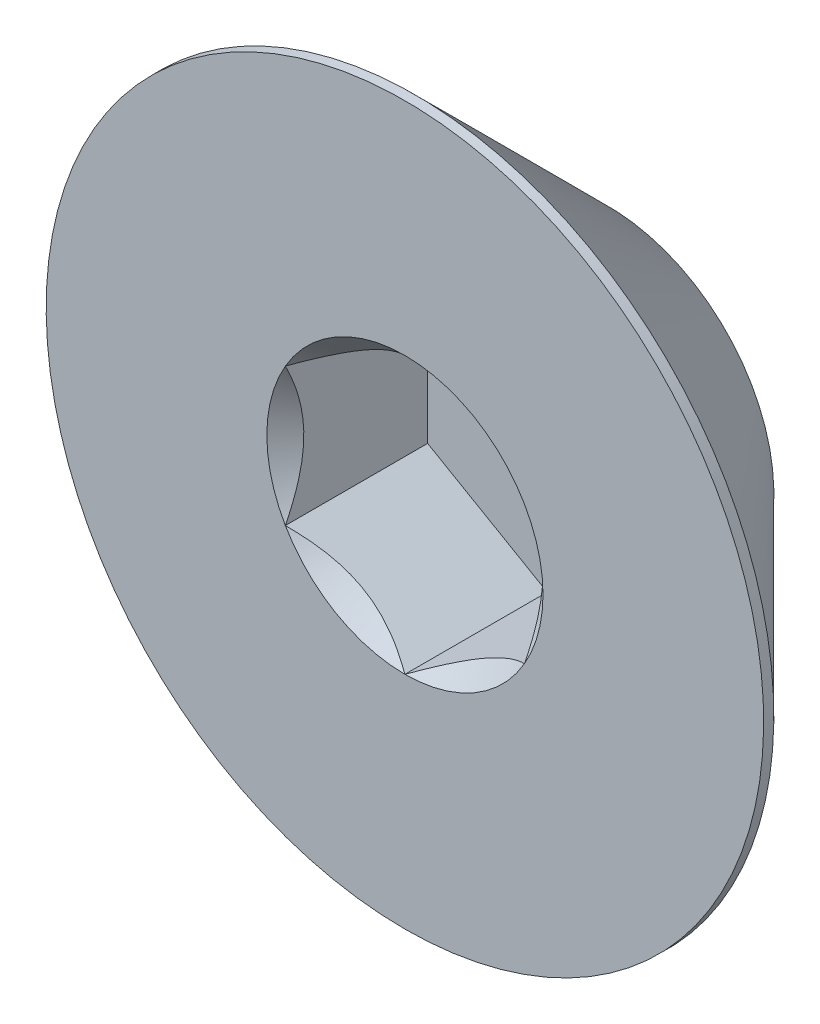
ISO-10303-21;
HEADER;
FILE_DESCRIPTION(('STEP AP214'),'2;1');
FILE_NAME('part.step','',(''),(''),'','','');
FILE_SCHEMA(('AUTOMOTIVE_DESIGN { 1 0 10303 214 1 1 1 1 }'));
ENDSEC;
DATA;
#1=APPLICATION_CONTEXT('core data for automotive mechanical design processes');
#2=APPLICATION_PROTOCOL_DEFINITION('international standard','automotive_design',2000,#1);
#3=PRODUCT_CONTEXT('',#1,'mechanical');
#4=PRODUCT('Part','Part','',(#3));
#5=PRODUCT_RELATED_PRODUCT_CATEGORY('part','',(#4));
#6=PRODUCT_DEFINITION_FORMATION('','',#4);
#7=PRODUCT_DEFINITION_CONTEXT('part definition',#1,'design');
#8=PRODUCT_DEFINITION('design','',#6,#7);
#9=PRODUCT_DEFINITION_SHAPE('','',#8);
#10=(LENGTH_UNIT() NAMED_UNIT(*) SI_UNIT(.MILLI.,.METRE.));
#11=(NAMED_UNIT(*) PLANE_ANGLE_UNIT() SI_UNIT($,.RADIAN.));
#12=(NAMED_UNIT(*) SI_UNIT($,.STERADIAN.) SOLID_ANGLE_UNIT());
#13=UNCERTAINTY_MEASURE_WITH_UNIT(LENGTH_MEASURE(1.E-05),#10,'distance_accuracy_value','');
#14=(GEOMETRIC_REPRESENTATION_CONTEXT(3) GLOBAL_UNCERTAINTY_ASSIGNED_CONTEXT((#13)) GLOBAL_UNIT_ASSIGNED_CONTEXT((#10,
#11,#12)) REPRESENTATION_CONTEXT('',''));
#15=CARTESIAN_POINT('',(0.,0.,0.));
#16=DIRECTION('',(0.,0.,1.));
#17=DIRECTION('',(1.,0.,0.));
#18=AXIS2_PLACEMENT_3D('',#15,#16,#17);
#19=CARTESIAN_POINT('',(0.,0.,3.));
#20=DIRECTION('',(0.,0.,-1.));
#21=DIRECTION('',(0.,1.,0.));
#22=AXIS2_PLACEMENT_3D('',#19,#20,#21);
#23=PLANE('',#22);
#24=CARTESIAN_POINT('',(0.,0.,3.));
#25=DIRECTION('',(0.,0.,1.));
#26=DIRECTION('',(0.,-1.,0.));
#27=AXIS2_PLACEMENT_3D('',#24,#25,#26);
#28=CIRCLE('',#27,3.);
#29=CARTESIAN_POINT('',(0.,-3.,3.));
#30=VERTEX_POINT('',#29);
#31=EDGE_CURVE('E222',#30,#30,#28,.T.);
#32=ORIENTED_EDGE('',*,*,#31,.T.);
#33=EDGE_LOOP('',(#32));
#34=FACE_BOUND('',#33,.T.);
#35=CARTESIAN_POINT('',(0.,0.,3.));
#36=DIRECTION('',(0.,0.,-1.));
#37=DIRECTION('',(-1.,0.,0.));
#38=AXIS2_PLACEMENT_3D('',#35,#36,#37);
#39=CIRCLE('',#38,1.15470053837925);
#40=CARTESIAN_POINT('',(-1.,0.577350269189623,3.));
#41=VERTEX_POINT('',#40);
#42=CARTESIAN_POINT('',(0.,1.15470053837925,3.));
#43=VERTEX_POINT('',#42);
#44=EDGE_CURVE('E138',#41,#43,#39,.T.);
#45=ORIENTED_EDGE('',*,*,#44,.T.);
#46=CARTESIAN_POINT('',(1.,0.577350269189625,3.));
#47=VERTEX_POINT('',#46);
#48=EDGE_CURVE('E137',#43,#47,#39,.T.);
#49=ORIENTED_EDGE('',*,*,#48,.T.);
#50=CARTESIAN_POINT('',(1.,-0.577350269189626,3.));
#51=VERTEX_POINT('',#50);
#52=EDGE_CURVE('E109',#47,#51,#39,.T.);
#53=ORIENTED_EDGE('',*,*,#52,.T.);
#54=CARTESIAN_POINT('',(0.,-1.15470053837925,3.));
#55=VERTEX_POINT('',#54);
#56=EDGE_CURVE('E102',#51,#55,#39,.T.);
#57=ORIENTED_EDGE('',*,*,#56,.T.);
#58=CARTESIAN_POINT('',(-1.,-0.577350269189628,3.));
#59=VERTEX_POINT('',#58);
#60=EDGE_CURVE('E63',#55,#59,#39,.T.);
#61=ORIENTED_EDGE('',*,*,#60,.T.);
#62=EDGE_CURVE('E70',#59,#41,#39,.T.);
#63=ORIENTED_EDGE('',*,*,#62,.T.);
#64=EDGE_LOOP('',(#45,#49,#53,#57,#61,#63));
#65=FACE_BOUND('',#64,.T.);
#66=ADVANCED_FACE('F43',(#34,#65),#23,.F.);
#67=CARTESIAN_POINT('',(0.,0.,2.915));
#68=DIRECTION('',(0.,0.,1.));
#69=DIRECTION('',(0.,-1.,0.));
#70=AXIS2_PLACEMENT_3D('',#67,#68,#69);
#71=CONICAL_SURFACE('',#70,3.,0.785398163397448);
#72=CARTESIAN_POINT('',(0.,0.,1.3));
#73=DIRECTION('',(0.,0.,1.));
#74=DIRECTION('',(0.,-1.,0.));
#75=AXIS2_PLACEMENT_3D('',#72,#73,#74);
#76=CIRCLE('',#75,1.385);
#77=CARTESIAN_POINT('',(0.,-1.385,1.3));
#78=VERTEX_POINT('',#77);
#79=EDGE_CURVE('E223',#78,#78,#76,.T.);
#80=ORIENTED_EDGE('',*,*,#79,.T.);
#81=EDGE_LOOP('',(#80));
#82=FACE_BOUND('',#81,.T.);
#83=CARTESIAN_POINT('',(0.,0.,2.915));
#84=DIRECTION('',(0.,0.,1.));
#85=DIRECTION('',(0.,-1.,0.));
#86=AXIS2_PLACEMENT_3D('',#83,#84,#85);
#87=CIRCLE('',#86,3.);
#88=CARTESIAN_POINT('',(0.,-3.,2.915));
#89=VERTEX_POINT('',#88);
#90=EDGE_CURVE('E57',#89,#89,#87,.T.);
#91=ORIENTED_EDGE('',*,*,#90,.F.);
#92=EDGE_LOOP('',(#91));
#93=FACE_BOUND('',#92,.T.);
#94=ADVANCED_FACE('F45',(#82,#93),#71,.T.);
#95=CARTESIAN_POINT('',(0.,0.,3.));
#96=DIRECTION('',(0.,0.,1.));
#97=DIRECTION('',(0.,-1.,0.));
#98=AXIS2_PLACEMENT_3D('',#95,#96,#97);
#99=CYLINDRICAL_SURFACE('',#98,3.);
#100=ORIENTED_EDGE('',*,*,#90,.T.);
#101=EDGE_LOOP('',(#100));
#102=FACE_BOUND('',#101,.T.);
#103=ORIENTED_EDGE('',*,*,#31,.F.);
#104=EDGE_LOOP('',(#103));
#105=FACE_BOUND('',#104,.T.);
#106=ADVANCED_FACE('F207',(#102,#105),#99,.T.);
#107=CARTESIAN_POINT('',(0.,0.,1.3));
#108=DIRECTION('',(0.,0.,-1.));
#109=DIRECTION('',(0.,1.,0.));
#110=AXIS2_PLACEMENT_3D('',#107,#108,#109);
#111=PLANE('',#110);
#112=ORIENTED_EDGE('',*,*,#79,.F.);
#113=EDGE_LOOP('',(#112));
#114=FACE_BOUND('',#113,.T.);
#115=ADVANCED_FACE('F211',(#114),#111,.T.);
#116=CARTESIAN_POINT('',(0.,0.,3.));
#117=DIRECTION('',(0.,0.,1.));
#118=DIRECTION('',(-1.,0.,0.));
#119=AXIS2_PLACEMENT_3D('',#116,#117,#118);
#120=CONICAL_SURFACE('',#119,1.15470053837925,0.78539816339745);
#121=CARTESIAN_POINT('',(1.,-1.15147208646462,3.37038567751387));
#122=CARTESIAN_POINT('',(1.,-1.12343447988552,3.34921991987372));
#123=CARTESIAN_POINT('',(1.,-1.09524064850698,3.32826169217591));
#124=CARTESIAN_POINT('',(1.,-1.03847715644377,3.28684602223563));
#125=CARTESIAN_POINT('',(1.,-1.00990740382975,3.26638870612366));
#126=CARTESIAN_POINT('',(1.,-0.92312089433348,3.20560479495451));
#127=CARTESIAN_POINT('',(1.,-0.864253173759063,3.1661922289614));
#128=CARTESIAN_POINT('',(1.,-0.740809858258048,3.08882066420021));
#129=CARTESIAN_POINT('',(1.,-0.676100255137809,3.05107303911435));
#130=CARTESIAN_POINT('',(1.,-0.543448939049126,2.98202458755129));
#131=CARTESIAN_POINT('',(1.,-0.47551911202778,2.95070202784687));
#132=CARTESIAN_POINT('',(1.,-0.37355585033353,2.9123817788838));
#133=CARTESIAN_POINT('',(1.,-0.341031989670909,2.90138359164216));
#134=CARTESIAN_POINT('',(1.,-0.275199079052294,2.88199834214736));
#135=CARTESIAN_POINT('',(1.,-0.241889975173934,2.8736114597767));
#136=CARTESIAN_POINT('',(1.,-0.175247517042994,2.86002522071902));
#137=CARTESIAN_POINT('',(1.,-0.141925568218176,2.85477079076797));
#138=CARTESIAN_POINT('',(1.,-0.0749144362322797,2.84754868657089));
#139=CARTESIAN_POINT('',(1.,-0.0412251978501624,2.84558151361051));
#140=CARTESIAN_POINT('',(1.,0.0249580992634205,2.84508319839316));
#141=CARTESIAN_POINT('',(1.,0.057451282646039,2.84643026788864));
#142=CARTESIAN_POINT('',(1.,0.122148505701867,2.85221648449899));
#143=CARTESIAN_POINT('',(1.,0.154352610132926,2.85665492066154));
#144=CARTESIAN_POINT('',(1.,0.21879989886764,2.86845683014521));
#145=CARTESIAN_POINT('',(1.,0.251033743268954,2.87587054103851));
#146=CARTESIAN_POINT('',(1.,0.314797132354919,2.89322894249868));
#147=CARTESIAN_POINT('',(1.,0.346326735731005,2.90317342128883));
#148=CARTESIAN_POINT('',(1.,0.445594187730206,2.93822348255434));
#149=CARTESIAN_POINT('',(1.,0.511919139476037,2.96732085835673));
#150=CARTESIAN_POINT('',(1.,0.641453244657533,3.03201532968651));
#151=CARTESIAN_POINT('',(1.,0.704650133126345,3.06763577671524));
#152=CARTESIAN_POINT('',(1.,0.825428490174987,3.14112390134694));
#153=CARTESIAN_POINT('',(1.,0.883132947867685,3.17879194713547));
#154=CARTESIAN_POINT('',(1.,0.968148853704566,3.23702285294317));
#155=CARTESIAN_POINT('',(1.,0.996120570380285,3.25663847576286));
#156=CARTESIAN_POINT('',(1.,1.05168177729902,3.29638851706127));
#157=CARTESIAN_POINT('',(1.,1.079271369977,3.31652279219883));
#158=CARTESIAN_POINT('',(1.,1.10670185346329,3.33687211907297));
#159=B_SPLINE_CURVE_WITH_KNOTS('',3,(#121,#122,#123,#124,#125,#126,#127,#128,#129,#130,#131,
#132,#133,#134,#135,#136,#137,#138,#139,#140,#141,#142,#143,#144,#145,#146,#147,#148,#149,#150,
#151,#152,#153,#154,#155,#156,#157,#158),.UNSPECIFIED.,.F.,.F.,(4,2,2,2,2,2,2,2,2,2,2,2,2,2,2,2,
2,2,4),(0.,0.105386459083291,0.210799187330125,0.42323361156547,0.647793540908506,
0.871580877738613,0.974493074181424,1.07741235827202,1.17846428203205,1.27953161415763,
1.37694086739611,1.47432772585408,1.57343322804294,1.67253043972852,1.88917353996828,
2.10660791038813,2.31323734249844,2.41572589232045,2.51818641476504),.UNSPECIFIED.);
#160=EDGE_CURVE('E11',#47,#51,#159,.F.);
#161=ORIENTED_EDGE('',*,*,#160,.T.);
#162=ORIENTED_EDGE('',*,*,#52,.F.);
#163=EDGE_LOOP('',(#161,#162));
#164=FACE_BOUND('',#163,.T.);
#165=ADVANCED_FACE('F114',(#164),#120,.F.);
#166=CARTESIAN_POINT('',(-0.000199999999999349,1.15481600843309,3.00011548737261));
#167=CARTESIAN_POINT('',(0.0341825950071813,1.13496520795026,2.98027793082573));
#168=CARTESIAN_POINT('',(0.0691401181398255,1.11478247255942,2.96160502063889));
#169=CARTESIAN_POINT('',(0.14042280295609,1.07362739529219,2.92741474272316));
#170=CARTESIAN_POINT('',(0.176754750528984,1.0526511355808,2.91191640902346));
#171=CARTESIAN_POINT('',(0.250016613803311,1.01035337909803,2.88536730714227));
#172=CARTESIAN_POINT('',(0.286927851445414,0.989042666109241,2.87424977399693));
#173=CARTESIAN_POINT('',(0.361562729310859,0.945952199282692,2.85711986577618));
#174=CARTESIAN_POINT('',(0.399284088108636,0.924173762626597,2.85109469746667));
#175=CARTESIAN_POINT('',(0.464292198417933,0.886641312640015,2.84566055496749));
#176=CARTESIAN_POINT('',(0.491494371528172,0.870936130672276,2.84485693831673));
#177=CARTESIAN_POINT('',(0.545846040669112,0.839556179862849,2.84620669941689));
#178=CARTESIAN_POINT('',(0.572995523754876,0.823881418494924,2.8483607295472));
#179=CARTESIAN_POINT('',(0.65405627732696,0.777080970599367,2.85911697212847));
#180=CARTESIAN_POINT('',(0.707564140978427,0.746188191116431,2.87201455641536));
#181=CARTESIAN_POINT('',(0.801476065143432,0.69196811641965,2.90314073060218));
#182=CARTESIAN_POINT('',(0.842320523671835,0.668386557293372,2.91973779770184));
#183=CARTESIAN_POINT('',(0.922409637381945,0.622147085933681,2.95712492468529));
#184=CARTESIAN_POINT('',(0.96165901087044,0.599486449584575,2.9779013418174));
#185=CARTESIAN_POINT('',(1.0002,0.577234799135787,3.00011548737262));
#186=B_SPLINE_CURVE_WITH_KNOTS('',3,(#166,#167,#168,#169,#170,#171,#172,#173,#174,#175,#176,
#177,#178,#179,#180,#181,#182,#183,#184,#185),.UNSPECIFIED.,.F.,.F.,(4,2,2,2,2,2,2,2,2,4),(0.,
0.133237676828559,0.26725222983449,0.399137076269299,0.530689603280767,0.624814864263845,
0.718960890149132,0.907306626112096,1.05710100361789,1.20641411519286),.UNSPECIFIED.);
#187=EDGE_CURVE('E140',#43,#47,#186,.T.);
#188=ORIENTED_EDGE('',*,*,#187,.T.);
#189=ORIENTED_EDGE('',*,*,#48,.F.);
#190=EDGE_LOOP('',(#188,#189));
#191=FACE_BOUND('',#190,.T.);
#192=ADVANCED_FACE('F261',(#191),#120,.F.);
#193=CARTESIAN_POINT('',(-1.0002,0.577234799135787,3.00011548737261));
#194=CARTESIAN_POINT('',(-0.965817404992821,0.59708559961862,2.98027793082573));
#195=CARTESIAN_POINT('',(-0.930859881860177,0.617268335009455,2.96160502063889));
#196=CARTESIAN_POINT('',(-0.859577197043912,0.658423412276685,2.92741474272316));
#197=CARTESIAN_POINT('',(-0.823245249471017,0.679399671988079,2.91191640902346));
#198=CARTESIAN_POINT('',(-0.74998338619669,0.721697428470845,2.88536730714227));
#199=CARTESIAN_POINT('',(-0.713072148554587,0.743008141459636,2.87424977399693));
#200=CARTESIAN_POINT('',(-0.638437270689142,0.786098608286185,2.85711986577618));
#201=CARTESIAN_POINT('',(-0.600715911891365,0.80787704494228,2.85109469746667));
#202=CARTESIAN_POINT('',(-0.535707801582067,0.845409494928862,2.84566055496749));
#203=CARTESIAN_POINT('',(-0.508505628471828,0.861114676896601,2.84485693831673));
#204=CARTESIAN_POINT('',(-0.454153959330889,0.892494627706028,2.84620669941689));
#205=CARTESIAN_POINT('',(-0.427004476245125,0.908169389073953,2.8483607295472));
#206=CARTESIAN_POINT('',(-0.34594372267304,0.95496983696951,2.85911697212847));
#207=CARTESIAN_POINT('',(-0.292435859021573,0.985862616452446,2.87201455641536));
#208=CARTESIAN_POINT('',(-0.198523934856569,1.04008269114923,2.90314073060218));
#209=CARTESIAN_POINT('',(-0.157679476328166,1.06366425027551,2.91973779770184));
#210=CARTESIAN_POINT('',(-0.077590362618056,1.1099037216352,2.95712492468529));
#211=CARTESIAN_POINT('',(-0.0383409891295617,1.1325643579843,2.9779013418174));
#212=CARTESIAN_POINT('',(0.000200000000000743,1.15481600843309,3.00011548737261));
#213=B_SPLINE_CURVE_WITH_KNOTS('',3,(#193,#194,#195,#196,#197,#198,#199,#200,#201,#202,#203,
#204,#205,#206,#207,#208,#209,#210,#211,#212),.UNSPECIFIED.,.F.,.F.,(4,2,2,2,2,2,2,2,2,4),(0.,
0.133237676828559,0.267252229834491,0.399137076269301,0.53068960328077,0.624814864263847,
0.718960890149134,0.907306626112098,1.0571010036179,1.20641411519286),.UNSPECIFIED.);
#214=EDGE_CURVE('E147',#41,#43,#213,.T.);
#215=ORIENTED_EDGE('',*,*,#214,.T.);
#216=ORIENTED_EDGE('',*,*,#44,.F.);
#217=EDGE_LOOP('',(#215,#216));
#218=FACE_BOUND('',#217,.T.);
#219=ADVANCED_FACE('F257',(#218),#120,.F.);
#220=CARTESIAN_POINT('',(-1.,-1.15147208646462,3.37038567751387));
#221=CARTESIAN_POINT('',(-1.,-1.12343447988553,3.34921991987372));
#222=CARTESIAN_POINT('',(-1.,-1.09524064850698,3.32826169217592));
#223=CARTESIAN_POINT('',(-1.,-1.03847715644377,3.28684602223563));
#224=CARTESIAN_POINT('',(-1.,-1.00990740382976,3.26638870612366));
#225=CARTESIAN_POINT('',(-1.,-0.923120894333483,3.20560479495451));
#226=CARTESIAN_POINT('',(-1.,-0.864253173759066,3.1661922289614));
#227=CARTESIAN_POINT('',(-1.,-0.740809858258051,3.08882066420021));
#228=CARTESIAN_POINT('',(-1.,-0.676100255137812,3.05107303911435));
#229=CARTESIAN_POINT('',(-1.,-0.543448939049128,2.9820245875513));
#230=CARTESIAN_POINT('',(-1.,-0.475519112027782,2.95070202784687));
#231=CARTESIAN_POINT('',(-1.,-0.373555850333531,2.9123817788838));
#232=CARTESIAN_POINT('',(-1.,-0.34103198967091,2.90138359164216));
#233=CARTESIAN_POINT('',(-1.,-0.275199079052295,2.88199834214736));
#234=CARTESIAN_POINT('',(-1.,-0.241889975173935,2.8736114597767));
#235=CARTESIAN_POINT('',(-1.,-0.175247517042994,2.86002522071902));
#236=CARTESIAN_POINT('',(-1.,-0.141925568218177,2.85477079076797));
#237=CARTESIAN_POINT('',(-1.,-0.0749144362322805,2.84754868657089));
#238=CARTESIAN_POINT('',(-1.,-0.0412251978501632,2.84558151361051));
#239=CARTESIAN_POINT('',(-1.,0.0249580992634197,2.84508319839316));
#240=CARTESIAN_POINT('',(-1.,0.057451282646038,2.84643026788864));
#241=CARTESIAN_POINT('',(-1.,0.122148505701866,2.85221648449899));
#242=CARTESIAN_POINT('',(-1.,0.154352610132925,2.85665492066154));
#243=CARTESIAN_POINT('',(-1.,0.218799898867639,2.8684568301452));
#244=CARTESIAN_POINT('',(-1.,0.251033743268953,2.87587054103851));
#245=CARTESIAN_POINT('',(-1.,0.314797132354918,2.89322894249868));
#246=CARTESIAN_POINT('',(-1.,0.346326735731004,2.90317342128883));
#247=CARTESIAN_POINT('',(-1.,0.445594187730205,2.93822348255434));
#248=CARTESIAN_POINT('',(-1.,0.511919139476036,2.96732085835673));
#249=CARTESIAN_POINT('',(-1.,0.641453244657532,3.03201532968651));
#250=CARTESIAN_POINT('',(-1.,0.704650133126344,3.06763577671524));
#251=CARTESIAN_POINT('',(-1.,0.825428490174987,3.14112390134694));
#252=CARTESIAN_POINT('',(-1.,0.883132947867685,3.17879194713546));
#253=CARTESIAN_POINT('',(-1.,0.968148853704565,3.23702285294316));
#254=CARTESIAN_POINT('',(-1.,0.996120570380285,3.25663847576286));
#255=CARTESIAN_POINT('',(-1.,1.05168177729901,3.29638851706127));
#256=CARTESIAN_POINT('',(-1.,1.079271369977,3.31652279219883));
#257=CARTESIAN_POINT('',(-1.,1.10670185346329,3.33687211907297));
#258=B_SPLINE_CURVE_WITH_KNOTS('',3,(#220,#221,#222,#223,#224,#225,#226,#227,#228,#229,#230,
#231,#232,#233,#234,#235,#236,#237,#238,#239,#240,#241,#242,#243,#244,#245,#246,#247,#248,#249,
#250,#251,#252,#253,#254,#255,#256,#257),.UNSPECIFIED.,.F.,.F.,(4,2,2,2,2,2,2,2,2,2,2,2,2,2,2,2,
2,2,4),(0.,0.105386459083292,0.210799187330125,0.423233611565471,0.647793540908508,
0.871580877738616,0.974493074181428,1.07741235827202,1.17846428203205,1.27953161415763,
1.37694086739611,1.47432772585409,1.57343322804294,1.67253043972852,1.88917353996828,
2.10660791038814,2.31323734249844,2.41572589232045,2.51818641476504),.UNSPECIFIED.);
#259=EDGE_CURVE('E167',#59,#41,#258,.T.);
#260=ORIENTED_EDGE('',*,*,#259,.T.);
#261=ORIENTED_EDGE('',*,*,#62,.F.);
#262=EDGE_LOOP('',(#260,#261));
#263=FACE_BOUND('',#262,.T.);
#264=ADVANCED_FACE('F267',(#263),#120,.F.);
#265=CARTESIAN_POINT('',(0.000199999999999969,-1.15481600843309,3.00011548737262));
#266=CARTESIAN_POINT('',(-0.0341825950071807,-1.13496520795026,2.98027793082574));
#267=CARTESIAN_POINT('',(-0.069140118139825,-1.11478247255942,2.96160502063889));
#268=CARTESIAN_POINT('',(-0.14042280295609,-1.0736273952922,2.92741474272316));
#269=CARTESIAN_POINT('',(-0.176754750528985,-1.0526511355808,2.91191640902346));
#270=CARTESIAN_POINT('',(-0.250016613803312,-1.01035337909803,2.88536730714227));
#271=CARTESIAN_POINT('',(-0.286927851445415,-0.989042666109244,2.87424977399693));
#272=CARTESIAN_POINT('',(-0.36156272931086,-0.945952199282694,2.85711986577619));
#273=CARTESIAN_POINT('',(-0.399284088108637,-0.9241737626266,2.85109469746668));
#274=CARTESIAN_POINT('',(-0.464292198417935,-0.886641312640018,2.8456605549675));
#275=CARTESIAN_POINT('',(-0.491494371528173,-0.870936130672279,2.84485693831674));
#276=CARTESIAN_POINT('',(-0.545846040669113,-0.839556179862851,2.84620669941689));
#277=CARTESIAN_POINT('',(-0.572995523754877,-0.823881418494927,2.8483607295472));
#278=CARTESIAN_POINT('',(-0.654056277326962,-0.77708097059937,2.85911697212848));
#279=CARTESIAN_POINT('',(-0.707564140978429,-0.746188191116433,2.87201455641536));
#280=CARTESIAN_POINT('',(-0.801476065143434,-0.691968116419652,2.90314073060218));
#281=CARTESIAN_POINT('',(-0.842320523671836,-0.668386557293374,2.91973779770184));
#282=CARTESIAN_POINT('',(-0.922409637381945,-0.622147085933684,2.9571249246853));
#283=CARTESIAN_POINT('',(-0.961659010870439,-0.599486449584578,2.97790134181741));
#284=CARTESIAN_POINT('',(-1.0002,-0.577234799135791,3.00011548737262));
#285=B_SPLINE_CURVE_WITH_KNOTS('',3,(#265,#266,#267,#268,#269,#270,#271,#272,#273,#274,#275,
#276,#277,#278,#279,#280,#281,#282,#283,#284),.UNSPECIFIED.,.F.,.F.,(4,2,2,2,2,2,2,2,2,4),(0.,
0.13323767682856,0.267252229834491,0.399137076269301,0.53068960328077,0.624814864263848,
0.718960890149135,0.9073066261121,1.0571010036179,1.20641411519286),.UNSPECIFIED.);
#286=EDGE_CURVE('E126',#55,#59,#285,.T.);
#287=ORIENTED_EDGE('',*,*,#286,.T.);
#288=ORIENTED_EDGE('',*,*,#60,.F.);
#289=EDGE_LOOP('',(#287,#288));
#290=FACE_BOUND('',#289,.T.);
#291=ADVANCED_FACE('F160',(#290),#120,.F.);
#292=CARTESIAN_POINT('',(1.0002,-0.57723479913579,3.00011548737262));
#293=CARTESIAN_POINT('',(0.965817404992821,-0.597085599618624,2.98027793082574));
#294=CARTESIAN_POINT('',(0.930859881860177,-0.617268335009459,2.96160502063889));
#295=CARTESIAN_POINT('',(0.859577197043912,-0.658423412276688,2.92741474272316));
#296=CARTESIAN_POINT('',(0.823245249471018,-0.679399671988082,2.91191640902346));
#297=CARTESIAN_POINT('',(0.749983386196691,-0.721697428470849,2.88536730714227));
#298=CARTESIAN_POINT('',(0.713072148554587,-0.743008141459639,2.87424977399693));
#299=CARTESIAN_POINT('',(0.638437270689143,-0.786098608286189,2.85711986577619));
#300=CARTESIAN_POINT('',(0.600715911891366,-0.807877044942283,2.85109469746668));
#301=CARTESIAN_POINT('',(0.535707801582068,-0.845409494928865,2.8456605549675));
#302=CARTESIAN_POINT('',(0.50850562847183,-0.861114676896604,2.84485693831674));
#303=CARTESIAN_POINT('',(0.45415395933089,-0.892494627706031,2.84620669941689));
#304=CARTESIAN_POINT('',(0.427004476245126,-0.908169389073956,2.8483607295472));
#305=CARTESIAN_POINT('',(0.345943722673041,-0.954969836969514,2.85911697212847));
#306=CARTESIAN_POINT('',(0.292435859021574,-0.98586261645245,2.87201455641536));
#307=CARTESIAN_POINT('',(0.198523934856569,-1.04008269114923,2.90314073060218));
#308=CARTESIAN_POINT('',(0.157679476328166,-1.06366425027551,2.91973779770184));
#309=CARTESIAN_POINT('',(0.0775903626180566,-1.1099037216352,2.9571249246853));
#310=CARTESIAN_POINT('',(0.0383409891295624,-1.13256435798431,2.97790134181741));
#311=CARTESIAN_POINT('',(-0.000199999999999908,-1.15481600843309,3.00011548737262));
#312=B_SPLINE_CURVE_WITH_KNOTS('',3,(#292,#293,#294,#295,#296,#297,#298,#299,#300,#301,#302,
#303,#304,#305,#306,#307,#308,#309,#310,#311),.UNSPECIFIED.,.F.,.F.,(4,2,2,2,2,2,2,2,2,4),(0.,
0.133237676828559,0.26725222983449,0.3991370762693,0.530689603280768,0.624814864263846,
0.718960890149133,0.907306626112098,1.0571010036179,1.20641411519286),.UNSPECIFIED.);
#313=EDGE_CURVE('E105',#51,#55,#312,.T.);
#314=ORIENTED_EDGE('',*,*,#313,.T.);
#315=ORIENTED_EDGE('',*,*,#56,.F.);
#316=EDGE_LOOP('',(#314,#315));
#317=FACE_BOUND('',#316,.T.);
#318=ADVANCED_FACE('F103',(#317),#120,.F.);
#319=CARTESIAN_POINT('',(1.,-0.577350269189628,1.81));
#320=DIRECTION('',(0.,0.,1.));
#321=DIRECTION('',(1.,0.,0.));
#322=AXIS2_PLACEMENT_3D('',#319,#320,#321);
#323=PLANE('',#322);
#324=DIRECTION('',(0.866025403784438,0.5,0.));
#325=VECTOR('',#324,1.);
#326=CARTESIAN_POINT('',(0.,-1.15470053837926,1.81));
#327=LINE('',#326,#325);
#328=CARTESIAN_POINT('',(0.,-1.15470053837926,1.81));
#329=VERTEX_POINT('',#328);
#330=CARTESIAN_POINT('',(1.,-0.577350269189628,1.81));
#331=VERTEX_POINT('',#330);
#332=EDGE_CURVE('E125',#329,#331,#327,.T.);
#333=ORIENTED_EDGE('',*,*,#332,.T.);
#334=DIRECTION('',(0.,1.,0.));
#335=VECTOR('',#334,1.);
#336=CARTESIAN_POINT('',(1.,-0.577350269189628,1.81));
#337=LINE('',#336,#335);
#338=CARTESIAN_POINT('',(1.,0.577350269189625,1.81));
#339=VERTEX_POINT('',#338);
#340=EDGE_CURVE('E130',#331,#339,#337,.T.);
#341=ORIENTED_EDGE('',*,*,#340,.T.);
#342=DIRECTION('',(-0.866025403784439,0.5,0.));
#343=VECTOR('',#342,1.);
#344=CARTESIAN_POINT('',(1.,0.577350269189625,1.81));
#345=LINE('',#344,#343);
#346=CARTESIAN_POINT('',(0.,1.15470053837925,1.81));
#347=VERTEX_POINT('',#346);
#348=EDGE_CURVE('E247',#339,#347,#345,.T.);
#349=ORIENTED_EDGE('',*,*,#348,.T.);
#350=DIRECTION('',(-0.866025403784439,-0.5,0.));
#351=VECTOR('',#350,1.);
#352=CARTESIAN_POINT('',(0.,1.15470053837925,1.81));
#353=LINE('',#352,#351);
#354=CARTESIAN_POINT('',(-1.,0.577350269189625,1.81));
#355=VERTEX_POINT('',#354);
#356=EDGE_CURVE('E244',#347,#355,#353,.T.);
#357=ORIENTED_EDGE('',*,*,#356,.T.);
#358=DIRECTION('',(0.,-1.,0.));
#359=VECTOR('',#358,1.);
#360=CARTESIAN_POINT('',(-1.,0.577350269189625,1.81));
#361=LINE('',#360,#359);
#362=CARTESIAN_POINT('',(-1.,-0.577350269189629,1.81));
#363=VERTEX_POINT('',#362);
#364=EDGE_CURVE('E241',#355,#363,#361,.T.);
#365=ORIENTED_EDGE('',*,*,#364,.T.);
#366=DIRECTION('',(0.866025403784439,-0.5,0.));
#367=VECTOR('',#366,1.);
#368=CARTESIAN_POINT('',(-1.,-0.577350269189629,1.81));
#369=LINE('',#368,#367);
#370=EDGE_CURVE('E133',#363,#329,#369,.T.);
#371=ORIENTED_EDGE('',*,*,#370,.T.);
#372=EDGE_LOOP('',(#333,#341,#349,#357,#365,#371));
#373=FACE_BOUND('',#372,.T.);
#374=ADVANCED_FACE('F159',(#373),#323,.T.);
#375=CARTESIAN_POINT('',(1.,-0.577350269189628,1.81));
#376=DIRECTION('',(1.,0.,0.));
#377=DIRECTION('',(0.,1.,0.));
#378=AXIS2_PLACEMENT_3D('',#375,#376,#377);
#379=PLANE('',#378);
#380=ORIENTED_EDGE('',*,*,#160,.F.);
#381=DIRECTION('',(0.,0.,1.));
#382=VECTOR('',#381,1.);
#383=CARTESIAN_POINT('',(1.,0.577350269189625,1.81));
#384=LINE('',#383,#382);
#385=EDGE_CURVE('E132',#339,#47,#384,.T.);
#386=ORIENTED_EDGE('',*,*,#385,.F.);
#387=ORIENTED_EDGE('',*,*,#340,.F.);
#388=DIRECTION('',(0.,0.,1.));
#389=VECTOR('',#388,1.);
#390=CARTESIAN_POINT('',(1.,-0.577350269189628,1.81));
#391=LINE('',#390,#389);
#392=EDGE_CURVE('E122',#331,#51,#391,.T.);
#393=ORIENTED_EDGE('',*,*,#392,.T.);
#394=EDGE_LOOP('',(#380,#386,#387,#393));
#395=FACE_BOUND('',#394,.T.);
#396=ADVANCED_FACE('F128',(#395),#379,.F.);
#397=CARTESIAN_POINT('',(1.,0.577350269189625,1.81));
#398=DIRECTION('',(0.5,0.866025403784439,0.));
#399=DIRECTION('',(-0.866025403784439,0.5,0.));
#400=AXIS2_PLACEMENT_3D('',#397,#398,#399);
#401=PLANE('',#400);
#402=ORIENTED_EDGE('',*,*,#187,.F.);
#403=DIRECTION('',(0.,0.,1.));
#404=VECTOR('',#403,1.);
#405=CARTESIAN_POINT('',(0.,1.15470053837925,1.81));
#406=LINE('',#405,#404);
#407=EDGE_CURVE('E229',#347,#43,#406,.T.);
#408=ORIENTED_EDGE('',*,*,#407,.F.);
#409=ORIENTED_EDGE('',*,*,#348,.F.);
#410=ORIENTED_EDGE('',*,*,#385,.T.);
#411=EDGE_LOOP('',(#402,#408,#409,#410));
#412=FACE_BOUND('',#411,.T.);
#413=ADVANCED_FACE('F154',(#412),#401,.F.);
#414=CARTESIAN_POINT('',(0.,1.15470053837925,1.81));
#415=DIRECTION('',(-0.5,0.866025403784439,0.));
#416=DIRECTION('',(-0.866025403784439,-0.5,0.));
#417=AXIS2_PLACEMENT_3D('',#414,#415,#416);
#418=PLANE('',#417);
#419=ORIENTED_EDGE('',*,*,#214,.F.);
#420=DIRECTION('',(0.,0.,1.));
#421=VECTOR('',#420,1.);
#422=CARTESIAN_POINT('',(-1.,0.577350269189625,1.81));
#423=LINE('',#422,#421);
#424=EDGE_CURVE('E232',#355,#41,#423,.T.);
#425=ORIENTED_EDGE('',*,*,#424,.F.);
#426=ORIENTED_EDGE('',*,*,#356,.F.);
#427=ORIENTED_EDGE('',*,*,#407,.T.);
#428=EDGE_LOOP('',(#419,#425,#426,#427));
#429=FACE_BOUND('',#428,.T.);
#430=ADVANCED_FACE('F191',(#429),#418,.F.);
#431=CARTESIAN_POINT('',(-1.,0.577350269189625,1.81));
#432=DIRECTION('',(-1.,0.,0.));
#433=DIRECTION('',(0.,-1.,0.));
#434=AXIS2_PLACEMENT_3D('',#431,#432,#433);
#435=PLANE('',#434);
#436=ORIENTED_EDGE('',*,*,#259,.F.);
#437=DIRECTION('',(0.,0.,1.));
#438=VECTOR('',#437,1.);
#439=CARTESIAN_POINT('',(-1.,-0.577350269189629,1.81));
#440=LINE('',#439,#438);
#441=EDGE_CURVE('E235',#363,#59,#440,.T.);
#442=ORIENTED_EDGE('',*,*,#441,.F.);
#443=ORIENTED_EDGE('',*,*,#364,.F.);
#444=ORIENTED_EDGE('',*,*,#424,.T.);
#445=EDGE_LOOP('',(#436,#442,#443,#444));
#446=FACE_BOUND('',#445,.T.);
#447=ADVANCED_FACE('F187',(#446),#435,.F.);
#448=CARTESIAN_POINT('',(-1.,-0.577350269189629,1.81));
#449=DIRECTION('',(-0.5,-0.866025403784439,0.));
#450=DIRECTION('',(0.866025403784439,-0.5,0.));
#451=AXIS2_PLACEMENT_3D('',#448,#449,#450);
#452=PLANE('',#451);
#453=ORIENTED_EDGE('',*,*,#286,.F.);
#454=DIRECTION('',(0.,0.,1.));
#455=VECTOR('',#454,1.);
#456=CARTESIAN_POINT('',(0.,-1.15470053837926,1.81));
#457=LINE('',#456,#455);
#458=EDGE_CURVE('E124',#329,#55,#457,.T.);
#459=ORIENTED_EDGE('',*,*,#458,.F.);
#460=ORIENTED_EDGE('',*,*,#370,.F.);
#461=ORIENTED_EDGE('',*,*,#441,.T.);
#462=EDGE_LOOP('',(#453,#459,#460,#461));
#463=FACE_BOUND('',#462,.T.);
#464=ADVANCED_FACE('F184',(#463),#452,.F.);
#465=CARTESIAN_POINT('',(0.,-1.15470053837926,1.81));
#466=DIRECTION('',(0.5,-0.866025403784439,0.));
#467=DIRECTION('',(0.866025403784439,0.5,0.));
#468=AXIS2_PLACEMENT_3D('',#465,#466,#467);
#469=PLANE('',#468);
#470=ORIENTED_EDGE('',*,*,#313,.F.);
#471=ORIENTED_EDGE('',*,*,#392,.F.);
#472=ORIENTED_EDGE('',*,*,#332,.F.);
#473=ORIENTED_EDGE('',*,*,#458,.T.);
#474=EDGE_LOOP('',(#470,#471,#472,#473));
#475=FACE_BOUND('',#474,.T.);
#476=ADVANCED_FACE('F120',(#475),#469,.F.);
#477=CLOSED_SHELL('',(#66,#94,#106,#115,#165,#192,#219,#264,#291,#318,#374,#396,#413,#430,#447,
#464,#476));
#478=MANIFOLD_SOLID_BREP('B2',#477);
#479=ADVANCED_BREP_SHAPE_REPRESENTATION('',(#18,#478),#14);
#480=SHAPE_DEFINITION_REPRESENTATION(#9,#479);
ENDSEC;
END-ISO-10303-21;
